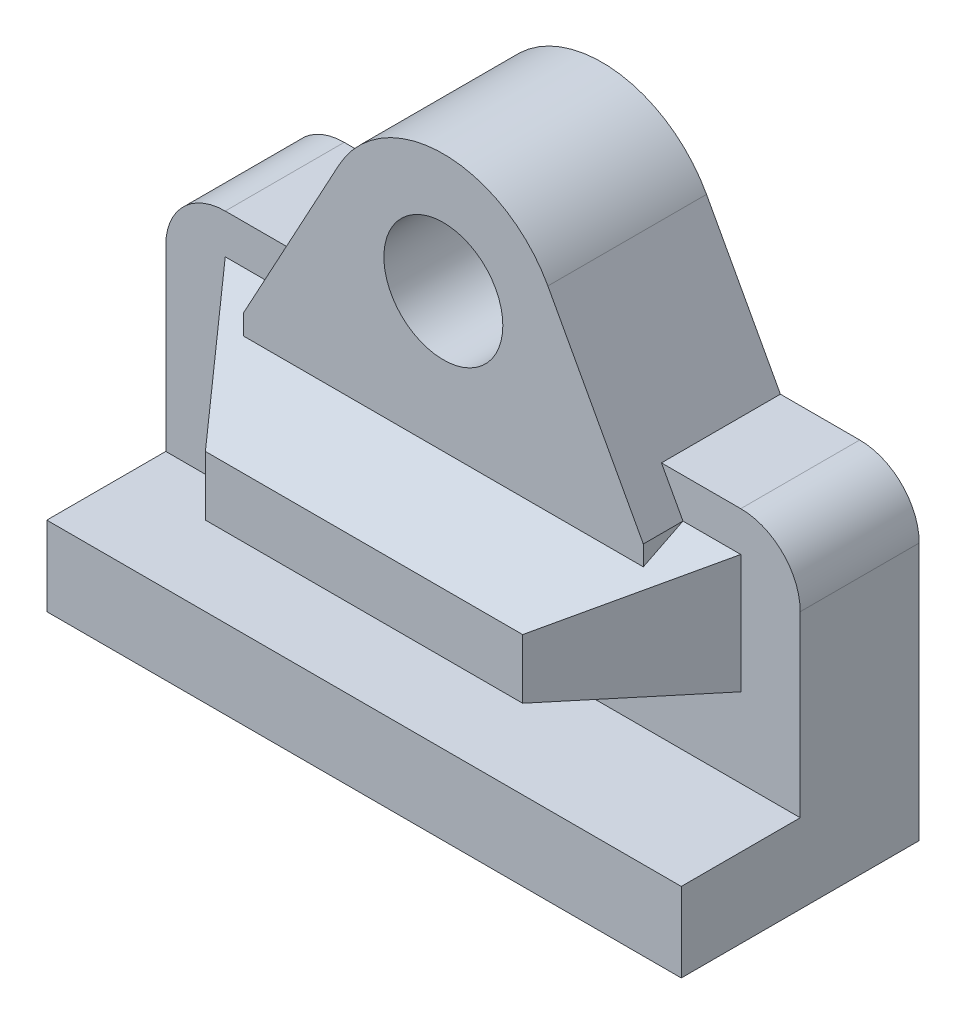
ISO-10303-21;
HEADER;
FILE_DESCRIPTION(('STEP AP214'),'2;1');
FILE_NAME('part.step','',(''),(''),'','','');
FILE_SCHEMA(('AUTOMOTIVE_DESIGN { 1 0 10303 214 1 1 1 1 }'));
ENDSEC;
DATA;
#1=APPLICATION_CONTEXT('core data for automotive mechanical design processes');
#2=APPLICATION_PROTOCOL_DEFINITION('international standard','automotive_design',2000,#1);
#3=PRODUCT_CONTEXT('',#1,'mechanical');
#4=PRODUCT('Part','Part','',(#3));
#5=PRODUCT_RELATED_PRODUCT_CATEGORY('part','',(#4));
#6=PRODUCT_DEFINITION_FORMATION('','',#4);
#7=PRODUCT_DEFINITION_CONTEXT('part definition',#1,'design');
#8=PRODUCT_DEFINITION('design','',#6,#7);
#9=PRODUCT_DEFINITION_SHAPE('','',#8);
#10=(LENGTH_UNIT() NAMED_UNIT(*) SI_UNIT(.MILLI.,.METRE.));
#11=(NAMED_UNIT(*) PLANE_ANGLE_UNIT() SI_UNIT($,.RADIAN.));
#12=(NAMED_UNIT(*) SI_UNIT($,.STERADIAN.) SOLID_ANGLE_UNIT());
#13=UNCERTAINTY_MEASURE_WITH_UNIT(LENGTH_MEASURE(1.E-05),#10,'distance_accuracy_value','');
#14=(GEOMETRIC_REPRESENTATION_CONTEXT(3) GLOBAL_UNCERTAINTY_ASSIGNED_CONTEXT((#13)) GLOBAL_UNIT_ASSIGNED_CONTEXT((#10,
#11,#12)) REPRESENTATION_CONTEXT('',''));
#15=CARTESIAN_POINT('',(0.,0.,0.));
#16=DIRECTION('',(0.,0.,1.));
#17=DIRECTION('',(1.,0.,0.));
#18=AXIS2_PLACEMENT_3D('',#15,#16,#17);
#19=CARTESIAN_POINT('',(0.,43.18,21.59));
#20=DIRECTION('',(0.,-0.894427190999916,-0.447213595499958));
#21=DIRECTION('',(0.,0.447213595499958,-0.894427190999916));
#22=AXIS2_PLACEMENT_3D('',#19,#20,#21);
#23=PLANE('',#22);
#24=DIRECTION('',(0.,-0.447213595499958,0.894427190999916));
#25=VECTOR('',#24,1.);
#26=CARTESIAN_POINT('',(82.8235256326022,30.5006067105464,46.9487865789073));
#27=LINE('',#26,#25);
#28=CARTESIAN_POINT('',(82.8235256326022,44.45,19.05));
#29=VERTEX_POINT('',#28);
#30=CARTESIAN_POINT('',(82.8235256326022,41.275,25.4));
#31=VERTEX_POINT('',#30);
#32=EDGE_CURVE('E61',#29,#31,#27,.T.);
#33=ORIENTED_EDGE('',*,*,#32,.T.);
#34=DIRECTION('',(-1.,0.,0.));
#35=VECTOR('',#34,1.);
#36=CARTESIAN_POINT('',(18.7764743673978,41.275,25.4));
#37=LINE('',#36,#35);
#38=CARTESIAN_POINT('',(18.7764743673977,41.275,25.4));
#39=VERTEX_POINT('',#38);
#40=EDGE_CURVE('E65',#31,#39,#37,.T.);
#41=ORIENTED_EDGE('',*,*,#40,.T.);
#42=DIRECTION('',(0.,0.447213595499958,-0.894427190999916));
#43=VECTOR('',#42,1.);
#44=CARTESIAN_POINT('',(18.7764743673977,30.5006067105464,46.9487865789073));
#45=LINE('',#44,#43);
#46=CARTESIAN_POINT('',(18.7764743673977,44.45,19.05));
#47=VERTEX_POINT('',#46);
#48=EDGE_CURVE('E200',#39,#47,#45,.T.);
#49=ORIENTED_EDGE('',*,*,#48,.T.);
#50=DIRECTION('',(-1.,0.,0.));
#51=VECTOR('',#50,1.);
#52=CARTESIAN_POINT('',(9.52500000000002,44.45,19.05));
#53=LINE('',#52,#51);
#54=CARTESIAN_POINT('',(9.52500000000002,44.45,19.05));
#55=VERTEX_POINT('',#54);
#56=EDGE_CURVE('E47',#47,#55,#53,.T.);
#57=ORIENTED_EDGE('',*,*,#56,.T.);
#58=DIRECTION('',(0.597614304667197,-0.358568582800319,0.717137165600636));
#59=VECTOR('',#58,1.);
#60=CARTESIAN_POINT('',(9.52500000000002,44.45,19.05));
#61=LINE('',#60,#59);
#62=CARTESIAN_POINT('',(25.4,34.925,38.1));
#63=VERTEX_POINT('',#62);
#64=EDGE_CURVE('E215',#55,#63,#61,.T.);
#65=ORIENTED_EDGE('',*,*,#64,.T.);
#66=DIRECTION('',(-1.,0.,0.));
#67=VECTOR('',#66,1.);
#68=CARTESIAN_POINT('',(76.2,34.925,38.1));
#69=LINE('',#68,#67);
#70=CARTESIAN_POINT('',(76.2,34.925,38.1));
#71=VERTEX_POINT('',#70);
#72=EDGE_CURVE('E277',#71,#63,#69,.T.);
#73=ORIENTED_EDGE('',*,*,#72,.F.);
#74=DIRECTION('',(-0.597614304667197,-0.358568582800318,0.717137165600636));
#75=VECTOR('',#74,1.);
#76=CARTESIAN_POINT('',(92.075,44.45,19.05));
#77=LINE('',#76,#75);
#78=CARTESIAN_POINT('',(92.075,44.45,19.05));
#79=VERTEX_POINT('',#78);
#80=EDGE_CURVE('E222',#79,#71,#77,.T.);
#81=ORIENTED_EDGE('',*,*,#80,.F.);
#82=EDGE_CURVE('E186',#79,#29,#53,.T.);
#83=ORIENTED_EDGE('',*,*,#82,.T.);
#84=EDGE_LOOP('',(#33,#41,#49,#57,#65,#73,#81,#83));
#85=FACE_BOUND('',#84,.T.);
#86=ADVANCED_FACE('F43',(#85),#23,.F.);
#87=CARTESIAN_POINT('',(0.,0.,19.05));
#88=DIRECTION('',(0.,0.,1.));
#89=DIRECTION('',(1.,0.,0.));
#90=AXIS2_PLACEMENT_3D('',#87,#88,#89);
#91=PLANE('',#90);
#92=ORIENTED_EDGE('',*,*,#56,.F.);
#93=DIRECTION('',(-0.477239660651135,-0.878773182511614,0.));
#94=VECTOR('',#93,1.);
#95=CARTESIAN_POINT('',(34.0593708731537,72.5914155354041,19.05));
#96=LINE('',#95,#94);
#97=CARTESIAN_POINT('',(22.2249999999999,50.8,19.05));
#98=VERTEX_POINT('',#97);
#99=EDGE_CURVE('E179',#98,#47,#96,.T.);
#100=ORIENTED_EDGE('',*,*,#99,.F.);
#101=DIRECTION('',(1.,0.,0.));
#102=VECTOR('',#101,1.);
#103=CARTESIAN_POINT('',(0.,50.8,19.05));
#104=LINE('',#103,#102);
#105=CARTESIAN_POINT('',(9.52500000000008,50.8,19.05));
#106=VERTEX_POINT('',#105);
#107=EDGE_CURVE('E459',#106,#98,#104,.T.);
#108=ORIENTED_EDGE('',*,*,#107,.F.);
#109=CARTESIAN_POINT('',(9.525,41.275,19.05));
#110=DIRECTION('',(0.,0.,1.));
#111=DIRECTION('',(1.,0.,0.));
#112=AXIS2_PLACEMENT_3D('',#109,#110,#111);
#113=CIRCLE('',#112,9.525);
#114=CARTESIAN_POINT('',(0.,41.2749999999999,19.05));
#115=VERTEX_POINT('',#114);
#116=EDGE_CURVE('E420',#115,#106,#113,.F.);
#117=ORIENTED_EDGE('',*,*,#116,.F.);
#118=DIRECTION('',(0.,1.,0.));
#119=VECTOR('',#118,1.);
#120=CARTESIAN_POINT('',(0.,0.,19.05));
#121=LINE('',#120,#119);
#122=CARTESIAN_POINT('',(0.,12.7,19.05));
#123=VERTEX_POINT('',#122);
#124=EDGE_CURVE('E415',#123,#115,#121,.T.);
#125=ORIENTED_EDGE('',*,*,#124,.F.);
#126=DIRECTION('',(-1.,0.,0.));
#127=VECTOR('',#126,1.);
#128=CARTESIAN_POINT('',(0.,12.7,19.05));
#129=LINE('',#128,#127);
#130=CARTESIAN_POINT('',(101.6,12.7,19.05));
#131=VERTEX_POINT('',#130);
#132=EDGE_CURVE('E403',#131,#123,#129,.T.);
#133=ORIENTED_EDGE('',*,*,#132,.F.);
#134=DIRECTION('',(0.,1.,0.));
#135=VECTOR('',#134,1.);
#136=CARTESIAN_POINT('',(101.6,0.,19.05));
#137=LINE('',#136,#135);
#138=CARTESIAN_POINT('',(101.6,41.2749999999999,19.05));
#139=VERTEX_POINT('',#138);
#140=EDGE_CURVE('E399',#131,#139,#137,.T.);
#141=ORIENTED_EDGE('',*,*,#140,.T.);
#142=CARTESIAN_POINT('',(92.075,41.275,19.05));
#143=DIRECTION('',(0.,0.,1.));
#144=DIRECTION('',(1.,0.,0.));
#145=AXIS2_PLACEMENT_3D('',#142,#143,#144);
#146=CIRCLE('',#145,9.52500000000001);
#147=CARTESIAN_POINT('',(92.0749999999999,50.8,19.05));
#148=VERTEX_POINT('',#147);
#149=EDGE_CURVE('E457',#139,#148,#146,.T.);
#150=ORIENTED_EDGE('',*,*,#149,.T.);
#151=DIRECTION('',(-1.,0.,0.));
#152=VECTOR('',#151,1.);
#153=CARTESIAN_POINT('',(0.,50.8,19.05));
#154=LINE('',#153,#152);
#155=CARTESIAN_POINT('',(79.375,50.8,19.05));
#156=VERTEX_POINT('',#155);
#157=EDGE_CURVE('E376',#148,#156,#154,.T.);
#158=ORIENTED_EDGE('',*,*,#157,.T.);
#159=DIRECTION('',(-0.477239660651134,0.878773182511614,0.));
#160=VECTOR('',#159,1.);
#161=CARTESIAN_POINT('',(67.5406291268463,72.5914155354041,19.05));
#162=LINE('',#161,#160);
#163=EDGE_CURVE('E197',#29,#156,#162,.T.);
#164=ORIENTED_EDGE('',*,*,#163,.F.);
#165=ORIENTED_EDGE('',*,*,#82,.F.);
#166=DIRECTION('',(0.,1.,0.));
#167=VECTOR('',#166,1.);
#168=CARTESIAN_POINT('',(92.075,25.4,19.05));
#169=LINE('',#168,#167);
#170=CARTESIAN_POINT('',(92.075,25.4,19.05));
#171=VERTEX_POINT('',#170);
#172=EDGE_CURVE('E478',#171,#79,#169,.T.);
#173=ORIENTED_EDGE('',*,*,#172,.F.);
#174=DIRECTION('',(1.,0.,0.));
#175=VECTOR('',#174,1.);
#176=CARTESIAN_POINT('',(9.52500000000002,25.4,19.05));
#177=LINE('',#176,#175);
#178=CARTESIAN_POINT('',(9.52500000000002,25.4,19.05));
#179=VERTEX_POINT('',#178);
#180=EDGE_CURVE('E216',#179,#171,#177,.T.);
#181=ORIENTED_EDGE('',*,*,#180,.F.);
#182=DIRECTION('',(0.,-1.,0.));
#183=VECTOR('',#182,1.);
#184=CARTESIAN_POINT('',(9.52500000000002,25.4,19.05));
#185=LINE('',#184,#183);
#186=EDGE_CURVE('E183',#55,#179,#185,.T.);
#187=ORIENTED_EDGE('',*,*,#186,.F.);
#188=EDGE_LOOP('',(#92,#100,#108,#117,#125,#133,#141,#150,#158,#164,#165,#173,#181,#187));
#189=FACE_BOUND('',#188,.T.);
#190=ADVANCED_FACE('F177',(#189),#91,.T.);
#191=CARTESIAN_POINT('',(101.6,0.,19.05));
#192=DIRECTION('',(-1.,0.,0.));
#193=DIRECTION('',(0.,0.,1.));
#194=AXIS2_PLACEMENT_3D('',#191,#192,#193);
#195=PLANE('',#194);
#196=DIRECTION('',(0.,1.,0.));
#197=VECTOR('',#196,1.);
#198=CARTESIAN_POINT('',(101.6,0.,0.));
#199=LINE('',#198,#197);
#200=CARTESIAN_POINT('',(101.6,0.,0.));
#201=VERTEX_POINT('',#200);
#202=CARTESIAN_POINT('',(101.6,41.2749999999999,0.));
#203=VERTEX_POINT('',#202);
#204=EDGE_CURVE('E370',#201,#203,#199,.T.);
#205=ORIENTED_EDGE('',*,*,#204,.T.);
#206=DIRECTION('',(0.,0.,-1.));
#207=VECTOR('',#206,1.);
#208=CARTESIAN_POINT('',(101.6,41.2749999999999,19.05));
#209=LINE('',#208,#207);
#210=EDGE_CURVE('E12',#139,#203,#209,.T.);
#211=ORIENTED_EDGE('',*,*,#210,.F.);
#212=ORIENTED_EDGE('',*,*,#140,.F.);
#213=DIRECTION('',(0.,0.,-1.));
#214=VECTOR('',#213,1.);
#215=CARTESIAN_POINT('',(101.6,12.7,38.1));
#216=LINE('',#215,#214);
#217=CARTESIAN_POINT('',(101.6,12.7,38.1));
#218=VERTEX_POINT('',#217);
#219=EDGE_CURVE('E452',#218,#131,#216,.T.);
#220=ORIENTED_EDGE('',*,*,#219,.F.);
#221=DIRECTION('',(0.,1.,0.));
#222=VECTOR('',#221,1.);
#223=CARTESIAN_POINT('',(101.6,0.,38.1));
#224=LINE('',#223,#222);
#225=CARTESIAN_POINT('',(101.6,0.,38.1));
#226=VERTEX_POINT('',#225);
#227=EDGE_CURVE('E446',#226,#218,#224,.T.);
#228=ORIENTED_EDGE('',*,*,#227,.F.);
#229=DIRECTION('',(0.,0.,-1.));
#230=VECTOR('',#229,1.);
#231=CARTESIAN_POINT('',(101.6,0.,38.1));
#232=LINE('',#231,#230);
#233=EDGE_CURVE('E428',#226,#201,#232,.T.);
#234=ORIENTED_EDGE('',*,*,#233,.T.);
#235=EDGE_LOOP('',(#205,#211,#212,#220,#228,#234));
#236=FACE_BOUND('',#235,.T.);
#237=ADVANCED_FACE('F316',(#236),#195,.F.);
#238=CARTESIAN_POINT('',(92.075,41.275,19.05));
#239=DIRECTION('',(0.,0.,-1.));
#240=DIRECTION('',(-1.,0.,0.));
#241=AXIS2_PLACEMENT_3D('',#238,#239,#240);
#242=CYLINDRICAL_SURFACE('',#241,9.52500000000001);
#243=CARTESIAN_POINT('',(92.075,41.275,0.));
#244=DIRECTION('',(0.,0.,1.));
#245=DIRECTION('',(1.,0.,0.));
#246=AXIS2_PLACEMENT_3D('',#243,#244,#245);
#247=CIRCLE('',#246,9.52500000000001);
#248=CARTESIAN_POINT('',(92.0749999999999,50.8,0.));
#249=VERTEX_POINT('',#248);
#250=EDGE_CURVE('E362',#203,#249,#247,.T.);
#251=ORIENTED_EDGE('',*,*,#250,.T.);
#252=DIRECTION('',(0.,0.,-1.));
#253=VECTOR('',#252,1.);
#254=CARTESIAN_POINT('',(92.0749999999999,50.8,19.05));
#255=LINE('',#254,#253);
#256=EDGE_CURVE('E53',#148,#249,#255,.T.);
#257=ORIENTED_EDGE('',*,*,#256,.F.);
#258=ORIENTED_EDGE('',*,*,#149,.F.);
#259=ORIENTED_EDGE('',*,*,#210,.T.);
#260=EDGE_LOOP('',(#251,#257,#258,#259));
#261=FACE_BOUND('',#260,.T.);
#262=ADVANCED_FACE('F321',(#261),#242,.T.);
#263=CARTESIAN_POINT('',(0.,50.8,19.05));
#264=DIRECTION('',(0.,-1.,0.));
#265=DIRECTION('',(0.,0.,-1.));
#266=AXIS2_PLACEMENT_3D('',#263,#264,#265);
#267=PLANE('',#266);
#268=DIRECTION('',(-1.,0.,0.));
#269=VECTOR('',#268,1.);
#270=CARTESIAN_POINT('',(0.,50.8,0.));
#271=LINE('',#270,#269);
#272=CARTESIAN_POINT('',(79.375,50.8,0.));
#273=VERTEX_POINT('',#272);
#274=EDGE_CURVE('E369',#249,#273,#271,.T.);
#275=ORIENTED_EDGE('',*,*,#274,.T.);
#276=DIRECTION('',(0.,0.,-1.));
#277=VECTOR('',#276,1.);
#278=CARTESIAN_POINT('',(79.375,50.8,19.05));
#279=LINE('',#278,#277);
#280=EDGE_CURVE('E377',#156,#273,#279,.T.);
#281=ORIENTED_EDGE('',*,*,#280,.F.);
#282=ORIENTED_EDGE('',*,*,#157,.F.);
#283=ORIENTED_EDGE('',*,*,#256,.T.);
#284=EDGE_LOOP('',(#275,#281,#282,#283));
#285=FACE_BOUND('',#284,.T.);
#286=ADVANCED_FACE('F352',(#285),#267,.F.);
#287=CARTESIAN_POINT('',(82.6015121655757,44.8588081881398,19.05));
#288=DIRECTION('',(0.878773182511615,0.477239660651132,0.));
#289=DIRECTION('',(-0.477239660651132,0.878773182511615,0.));
#290=AXIS2_PLACEMENT_3D('',#287,#288,#289);
#291=PLANE('',#290);
#292=DIRECTION('',(0.477239660651132,-0.878773182511615,0.));
#293=VECTOR('',#292,1.);
#294=CARTESIAN_POINT('',(82.6015121655757,44.8588081881398,0.));
#295=LINE('',#294,#293);
#296=CARTESIAN_POINT('',(67.5406291268463,72.5914155354041,0.));
#297=VERTEX_POINT('',#296);
#298=EDGE_CURVE('E381',#297,#273,#295,.T.);
#299=ORIENTED_EDGE('',*,*,#298,.F.);
#300=DIRECTION('',(0.,0.,-1.));
#301=VECTOR('',#300,1.);
#302=CARTESIAN_POINT('',(67.5406291268463,72.5914155354041,19.05));
#303=LINE('',#302,#301);
#304=CARTESIAN_POINT('',(67.5406291268463,72.5914155354041,25.4));
#305=VERTEX_POINT('',#304);
#306=EDGE_CURVE('E409',#305,#297,#303,.T.);
#307=ORIENTED_EDGE('',*,*,#306,.F.);
#308=DIRECTION('',(-0.477239660651134,0.878773182511614,0.));
#309=VECTOR('',#308,1.);
#310=CARTESIAN_POINT('',(67.5406291268463,72.5914155354041,25.4));
#311=LINE('',#310,#309);
#312=CARTESIAN_POINT('',(82.8235256326022,44.45,25.4));
#313=VERTEX_POINT('',#312);
#314=EDGE_CURVE('E209',#313,#305,#311,.T.);
#315=ORIENTED_EDGE('',*,*,#314,.F.);
#316=DIRECTION('',(0.,0.,-1.));
#317=VECTOR('',#316,1.);
#318=CARTESIAN_POINT('',(82.8235256326022,44.45,25.4));
#319=LINE('',#318,#317);
#320=EDGE_CURVE('E206',#313,#29,#319,.T.);
#321=ORIENTED_EDGE('',*,*,#320,.T.);
#322=ORIENTED_EDGE('',*,*,#163,.T.);
#323=ORIENTED_EDGE('',*,*,#280,.T.);
#324=EDGE_LOOP('',(#299,#307,#315,#321,#322,#323));
#325=FACE_BOUND('',#324,.T.);
#326=ADVANCED_FACE('F348',(#325),#291,.T.);
#327=CARTESIAN_POINT('',(50.8,63.5,19.05));
#328=DIRECTION('',(0.,0.,-1.));
#329=DIRECTION('',(-1.,0.,0.));
#330=AXIS2_PLACEMENT_3D('',#327,#328,#329);
#331=CYLINDRICAL_SURFACE('',#330,19.05);
#332=CARTESIAN_POINT('',(50.8,63.5,0.));
#333=DIRECTION('',(0.,0.,1.));
#334=DIRECTION('',(1.,0.,0.));
#335=AXIS2_PLACEMENT_3D('',#332,#333,#334);
#336=CIRCLE('',#335,19.05);
#337=CARTESIAN_POINT('',(34.0593708731537,72.5914155354041,0.));
#338=VERTEX_POINT('',#337);
#339=EDGE_CURVE('E383',#297,#338,#336,.T.);
#340=ORIENTED_EDGE('',*,*,#339,.T.);
#341=DIRECTION('',(0.,0.,-1.));
#342=VECTOR('',#341,1.);
#343=CARTESIAN_POINT('',(34.0593708731537,72.5914155354041,19.05));
#344=LINE('',#343,#342);
#345=CARTESIAN_POINT('',(34.0593708731537,72.5914155354041,25.4));
#346=VERTEX_POINT('',#345);
#347=EDGE_CURVE('E406',#346,#338,#344,.T.);
#348=ORIENTED_EDGE('',*,*,#347,.F.);
#349=CARTESIAN_POINT('',(50.8,63.5,25.4));
#350=DIRECTION('',(0.,0.,1.));
#351=DIRECTION('',(1.,0.,0.));
#352=AXIS2_PLACEMENT_3D('',#349,#350,#351);
#353=CIRCLE('',#352,19.05);
#354=EDGE_CURVE('E491',#305,#346,#353,.T.);
#355=ORIENTED_EDGE('',*,*,#354,.F.);
#356=ORIENTED_EDGE('',*,*,#306,.T.);
#357=EDGE_LOOP('',(#340,#348,#355,#356));
#358=FACE_BOUND('',#357,.T.);
#359=ADVANCED_FACE('F345',(#358),#331,.T.);
#360=CARTESIAN_POINT('',(-4.14169384533395,2.24924998236611,19.05));
#361=DIRECTION('',(0.878773182511615,-0.477239660651132,0.));
#362=DIRECTION('',(0.477239660651132,0.878773182511615,0.));
#363=AXIS2_PLACEMENT_3D('',#360,#361,#362);
#364=PLANE('',#363);
#365=DIRECTION('',(-0.477239660651132,-0.878773182511615,0.));
#366=VECTOR('',#365,1.);
#367=CARTESIAN_POINT('',(-4.14169384533395,2.24924998236611,0.));
#368=LINE('',#367,#366);
#369=CARTESIAN_POINT('',(22.225,50.8,0.));
#370=VERTEX_POINT('',#369);
#371=EDGE_CURVE('E388',#338,#370,#368,.T.);
#372=ORIENTED_EDGE('',*,*,#371,.T.);
#373=DIRECTION('',(0.,0.,-1.));
#374=VECTOR('',#373,1.);
#375=CARTESIAN_POINT('',(22.225,50.8,19.05));
#376=LINE('',#375,#374);
#377=EDGE_CURVE('E195',#98,#370,#376,.T.);
#378=ORIENTED_EDGE('',*,*,#377,.F.);
#379=ORIENTED_EDGE('',*,*,#99,.T.);
#380=DIRECTION('',(0.,0.,-1.));
#381=VECTOR('',#380,1.);
#382=CARTESIAN_POINT('',(18.7764743673977,44.45,25.4));
#383=LINE('',#382,#381);
#384=CARTESIAN_POINT('',(18.7764743673977,44.45,25.4));
#385=VERTEX_POINT('',#384);
#386=EDGE_CURVE('E193',#385,#47,#383,.T.);
#387=ORIENTED_EDGE('',*,*,#386,.F.);
#388=DIRECTION('',(-0.477239660651135,-0.878773182511614,0.));
#389=VECTOR('',#388,1.);
#390=CARTESIAN_POINT('',(34.0593708731537,72.5914155354041,25.4));
#391=LINE('',#390,#389);
#392=EDGE_CURVE('E493',#346,#385,#391,.T.);
#393=ORIENTED_EDGE('',*,*,#392,.F.);
#394=ORIENTED_EDGE('',*,*,#347,.T.);
#395=EDGE_LOOP('',(#372,#378,#379,#387,#393,#394));
#396=FACE_BOUND('',#395,.T.);
#397=ADVANCED_FACE('F190',(#396),#364,.F.);
#398=CARTESIAN_POINT('',(0.,50.8,19.05));
#399=DIRECTION('',(0.,1.,0.));
#400=DIRECTION('',(-1.,0.,0.));
#401=AXIS2_PLACEMENT_3D('',#398,#399,#400);
#402=PLANE('',#401);
#403=DIRECTION('',(1.,0.,0.));
#404=VECTOR('',#403,1.);
#405=CARTESIAN_POINT('',(0.,50.8,0.));
#406=LINE('',#405,#404);
#407=CARTESIAN_POINT('',(9.52500000000008,50.8,0.));
#408=VERTEX_POINT('',#407);
#409=EDGE_CURVE('E390',#408,#370,#406,.T.);
#410=ORIENTED_EDGE('',*,*,#409,.F.);
#411=DIRECTION('',(0.,0.,-1.));
#412=VECTOR('',#411,1.);
#413=CARTESIAN_POINT('',(9.52500000000008,50.8,19.05));
#414=LINE('',#413,#412);
#415=EDGE_CURVE('E402',#106,#408,#414,.T.);
#416=ORIENTED_EDGE('',*,*,#415,.F.);
#417=ORIENTED_EDGE('',*,*,#107,.T.);
#418=ORIENTED_EDGE('',*,*,#377,.T.);
#419=EDGE_LOOP('',(#410,#416,#417,#418));
#420=FACE_BOUND('',#419,.T.);
#421=ADVANCED_FACE('F338',(#420),#402,.T.);
#422=CARTESIAN_POINT('',(9.525,41.275,19.05));
#423=DIRECTION('',(0.,0.,-1.));
#424=DIRECTION('',(-1.,0.,0.));
#425=AXIS2_PLACEMENT_3D('',#422,#423,#424);
#426=CYLINDRICAL_SURFACE('',#425,9.525);
#427=CARTESIAN_POINT('',(9.525,41.275,0.));
#428=DIRECTION('',(0.,0.,1.));
#429=DIRECTION('',(1.,0.,0.));
#430=AXIS2_PLACEMENT_3D('',#427,#428,#429);
#431=CIRCLE('',#430,9.525);
#432=CARTESIAN_POINT('',(0.,41.2749999999999,0.));
#433=VERTEX_POINT('',#432);
#434=EDGE_CURVE('E393',#433,#408,#431,.F.);
#435=ORIENTED_EDGE('',*,*,#434,.F.);
#436=DIRECTION('',(0.,0.,-1.));
#437=VECTOR('',#436,1.);
#438=CARTESIAN_POINT('',(0.,41.2749999999999,19.05));
#439=LINE('',#438,#437);
#440=EDGE_CURVE('E400',#115,#433,#439,.T.);
#441=ORIENTED_EDGE('',*,*,#440,.F.);
#442=ORIENTED_EDGE('',*,*,#116,.T.);
#443=ORIENTED_EDGE('',*,*,#415,.T.);
#444=EDGE_LOOP('',(#435,#441,#442,#443));
#445=FACE_BOUND('',#444,.T.);
#446=ADVANCED_FACE('F334',(#445),#426,.T.);
#447=CARTESIAN_POINT('',(0.,0.,19.05));
#448=DIRECTION('',(-1.,0.,0.));
#449=DIRECTION('',(0.,0.,1.));
#450=AXIS2_PLACEMENT_3D('',#447,#448,#449);
#451=PLANE('',#450);
#452=DIRECTION('',(0.,1.,0.));
#453=VECTOR('',#452,1.);
#454=CARTESIAN_POINT('',(0.,0.,0.));
#455=LINE('',#454,#453);
#456=CARTESIAN_POINT('',(0.,0.,0.));
#457=VERTEX_POINT('',#456);
#458=EDGE_CURVE('E396',#457,#433,#455,.T.);
#459=ORIENTED_EDGE('',*,*,#458,.F.);
#460=DIRECTION('',(0.,0.,-1.));
#461=VECTOR('',#460,1.);
#462=CARTESIAN_POINT('',(0.,0.,38.1));
#463=LINE('',#462,#461);
#464=CARTESIAN_POINT('',(0.,0.,38.1));
#465=VERTEX_POINT('',#464);
#466=EDGE_CURVE('E437',#465,#457,#463,.T.);
#467=ORIENTED_EDGE('',*,*,#466,.F.);
#468=DIRECTION('',(0.,-1.,0.));
#469=VECTOR('',#468,1.);
#470=CARTESIAN_POINT('',(0.,0.,38.1));
#471=LINE('',#470,#469);
#472=CARTESIAN_POINT('',(0.,12.7,38.1));
#473=VERTEX_POINT('',#472);
#474=EDGE_CURVE('E441',#473,#465,#471,.T.);
#475=ORIENTED_EDGE('',*,*,#474,.F.);
#476=DIRECTION('',(0.,0.,-1.));
#477=VECTOR('',#476,1.);
#478=CARTESIAN_POINT('',(0.,12.7,38.1));
#479=LINE('',#478,#477);
#480=EDGE_CURVE('E424',#473,#123,#479,.T.);
#481=ORIENTED_EDGE('',*,*,#480,.T.);
#482=ORIENTED_EDGE('',*,*,#124,.T.);
#483=ORIENTED_EDGE('',*,*,#440,.T.);
#484=EDGE_LOOP('',(#459,#467,#475,#481,#482,#483));
#485=FACE_BOUND('',#484,.T.);
#486=ADVANCED_FACE('F331',(#485),#451,.T.);
#487=CARTESIAN_POINT('',(50.8,63.5,19.05));
#488=DIRECTION('',(0.,0.,-1.));
#489=DIRECTION('',(-1.,0.,0.));
#490=AXIS2_PLACEMENT_3D('',#487,#488,#489);
#491=CYLINDRICAL_SURFACE('',#490,9.52500000000001);
#492=CARTESIAN_POINT('',(50.8,63.5,0.));
#493=DIRECTION('',(0.,0.,1.));
#494=DIRECTION('',(1.,0.,0.));
#495=AXIS2_PLACEMENT_3D('',#492,#493,#494);
#496=CIRCLE('',#495,9.52500000000001);
#497=CARTESIAN_POINT('',(60.325,63.5,0.));
#498=VERTEX_POINT('',#497);
#499=EDGE_CURVE('E422',#498,#498,#496,.T.);
#500=ORIENTED_EDGE('',*,*,#499,.F.);
#501=EDGE_LOOP('',(#500));
#502=FACE_BOUND('',#501,.T.);
#503=CARTESIAN_POINT('',(50.8,63.5,25.4));
#504=DIRECTION('',(0.,0.,1.));
#505=DIRECTION('',(1.,0.,0.));
#506=AXIS2_PLACEMENT_3D('',#503,#504,#505);
#507=CIRCLE('',#506,9.52500000000002);
#508=CARTESIAN_POINT('',(60.325,63.5,25.4));
#509=VERTEX_POINT('',#508);
#510=EDGE_CURVE('E198',#509,#509,#507,.T.);
#511=ORIENTED_EDGE('',*,*,#510,.T.);
#512=EDGE_LOOP('',(#511));
#513=FACE_BOUND('',#512,.T.);
#514=ADVANCED_FACE('F45',(#502,#513),#491,.F.);
#515=CARTESIAN_POINT('',(0.,0.,0.));
#516=DIRECTION('',(0.,0.,1.));
#517=DIRECTION('',(1.,0.,0.));
#518=AXIS2_PLACEMENT_3D('',#515,#516,#517);
#519=PLANE('',#518);
#520=ORIENTED_EDGE('',*,*,#499,.T.);
#521=EDGE_LOOP('',(#520));
#522=FACE_BOUND('',#521,.T.);
#523=ORIENTED_EDGE('',*,*,#204,.F.);
#524=DIRECTION('',(1.,0.,0.));
#525=VECTOR('',#524,1.);
#526=CARTESIAN_POINT('',(0.,0.,0.));
#527=LINE('',#526,#525);
#528=EDGE_CURVE('E431',#457,#201,#527,.T.);
#529=ORIENTED_EDGE('',*,*,#528,.F.);
#530=ORIENTED_EDGE('',*,*,#458,.T.);
#531=ORIENTED_EDGE('',*,*,#434,.T.);
#532=ORIENTED_EDGE('',*,*,#409,.T.);
#533=ORIENTED_EDGE('',*,*,#371,.F.);
#534=ORIENTED_EDGE('',*,*,#339,.F.);
#535=ORIENTED_EDGE('',*,*,#298,.T.);
#536=ORIENTED_EDGE('',*,*,#274,.F.);
#537=ORIENTED_EDGE('',*,*,#250,.F.);
#538=EDGE_LOOP('',(#523,#529,#530,#531,#532,#533,#534,#535,#536,#537));
#539=FACE_BOUND('',#538,.T.);
#540=ADVANCED_FACE('F327',(#522,#539),#519,.F.);
#541=CARTESIAN_POINT('',(0.,12.7,38.1));
#542=DIRECTION('',(0.,-1.,0.));
#543=DIRECTION('',(1.,0.,0.));
#544=AXIS2_PLACEMENT_3D('',#541,#542,#543);
#545=PLANE('',#544);
#546=ORIENTED_EDGE('',*,*,#219,.T.);
#547=ORIENTED_EDGE('',*,*,#132,.T.);
#548=ORIENTED_EDGE('',*,*,#480,.F.);
#549=DIRECTION('',(-1.,0.,0.));
#550=VECTOR('',#549,1.);
#551=CARTESIAN_POINT('',(0.,12.7,38.1));
#552=LINE('',#551,#550);
#553=EDGE_CURVE('E438',#218,#473,#552,.T.);
#554=ORIENTED_EDGE('',*,*,#553,.F.);
#555=EDGE_LOOP('',(#546,#547,#548,#554));
#556=FACE_BOUND('',#555,.T.);
#557=ADVANCED_FACE('F325',(#556),#545,.F.);
#558=CARTESIAN_POINT('',(0.,0.,38.1));
#559=DIRECTION('',(0.,1.,0.));
#560=DIRECTION('',(0.,0.,1.));
#561=AXIS2_PLACEMENT_3D('',#558,#559,#560);
#562=PLANE('',#561);
#563=ORIENTED_EDGE('',*,*,#528,.T.);
#564=ORIENTED_EDGE('',*,*,#233,.F.);
#565=DIRECTION('',(1.,0.,0.));
#566=VECTOR('',#565,1.);
#567=CARTESIAN_POINT('',(0.,0.,38.1));
#568=LINE('',#567,#566);
#569=EDGE_CURVE('E512',#465,#226,#568,.T.);
#570=ORIENTED_EDGE('',*,*,#569,.F.);
#571=ORIENTED_EDGE('',*,*,#466,.T.);
#572=EDGE_LOOP('',(#563,#564,#570,#571));
#573=FACE_BOUND('',#572,.T.);
#574=ADVANCED_FACE('F434',(#573),#562,.F.);
#575=CARTESIAN_POINT('',(0.,0.,38.1));
#576=DIRECTION('',(0.,0.,1.));
#577=DIRECTION('',(1.,0.,0.));
#578=AXIS2_PLACEMENT_3D('',#575,#576,#577);
#579=PLANE('',#578);
#580=ORIENTED_EDGE('',*,*,#553,.T.);
#581=ORIENTED_EDGE('',*,*,#474,.T.);
#582=ORIENTED_EDGE('',*,*,#569,.T.);
#583=ORIENTED_EDGE('',*,*,#227,.T.);
#584=EDGE_LOOP('',(#580,#581,#582,#583));
#585=FACE_BOUND('',#584,.T.);
#586=ADVANCED_FACE('F556',(#585),#579,.T.);
#587=CARTESIAN_POINT('',(0.,0.,38.1));
#588=DIRECTION('',(0.,0.,1.));
#589=DIRECTION('',(1.,0.,0.));
#590=AXIS2_PLACEMENT_3D('',#587,#588,#589);
#591=PLANE('',#590);
#592=DIRECTION('',(0.,1.,0.));
#593=VECTOR('',#592,1.);
#594=CARTESIAN_POINT('',(76.2,25.4,38.1));
#595=LINE('',#594,#593);
#596=CARTESIAN_POINT('',(76.2,25.4,38.1));
#597=VERTEX_POINT('',#596);
#598=EDGE_CURVE('E227',#597,#71,#595,.T.);
#599=ORIENTED_EDGE('',*,*,#598,.T.);
#600=ORIENTED_EDGE('',*,*,#72,.T.);
#601=DIRECTION('',(0.,-1.,0.));
#602=VECTOR('',#601,1.);
#603=CARTESIAN_POINT('',(25.4,25.4,38.1));
#604=LINE('',#603,#602);
#605=CARTESIAN_POINT('',(25.4,25.4,38.1));
#606=VERTEX_POINT('',#605);
#607=EDGE_CURVE('E288',#63,#606,#604,.T.);
#608=ORIENTED_EDGE('',*,*,#607,.T.);
#609=DIRECTION('',(1.,0.,0.));
#610=VECTOR('',#609,1.);
#611=CARTESIAN_POINT('',(25.4,25.4,38.1));
#612=LINE('',#611,#610);
#613=EDGE_CURVE('E236',#606,#597,#612,.T.);
#614=ORIENTED_EDGE('',*,*,#613,.T.);
#615=EDGE_LOOP('',(#599,#600,#608,#614));
#616=FACE_BOUND('',#615,.T.);
#617=ADVANCED_FACE('F263',(#616),#591,.T.);
#618=CARTESIAN_POINT('',(-3.74754098360654,0.,3.12295081967212));
#619=DIRECTION('',(0.768221279597376,0.,-0.64018439966448));
#620=DIRECTION('',(-0.64018439966448,0.,-0.768221279597376));
#621=AXIS2_PLACEMENT_3D('',#618,#619,#620);
#622=PLANE('',#621);
#623=DIRECTION('',(0.64018439966448,0.,0.768221279597376));
#624=VECTOR('',#623,1.);
#625=CARTESIAN_POINT('',(9.52500000000002,25.4,19.05));
#626=LINE('',#625,#624);
#627=EDGE_CURVE('E213',#179,#606,#626,.T.);
#628=ORIENTED_EDGE('',*,*,#627,.T.);
#629=ORIENTED_EDGE('',*,*,#607,.F.);
#630=ORIENTED_EDGE('',*,*,#64,.F.);
#631=ORIENTED_EDGE('',*,*,#186,.T.);
#632=EDGE_LOOP('',(#628,#629,#630,#631));
#633=FACE_BOUND('',#632,.T.);
#634=ADVANCED_FACE('F255',(#633),#622,.F.);
#635=CARTESIAN_POINT('',(0.,25.4,0.));
#636=DIRECTION('',(0.,1.,0.));
#637=DIRECTION('',(-1.,0.,0.));
#638=AXIS2_PLACEMENT_3D('',#635,#636,#637);
#639=PLANE('',#638);
#640=DIRECTION('',(-0.64018439966448,0.,0.768221279597376));
#641=VECTOR('',#640,1.);
#642=CARTESIAN_POINT('',(92.075,25.4,19.05));
#643=LINE('',#642,#641);
#644=EDGE_CURVE('E219',#171,#597,#643,.T.);
#645=ORIENTED_EDGE('',*,*,#644,.T.);
#646=ORIENTED_EDGE('',*,*,#613,.F.);
#647=ORIENTED_EDGE('',*,*,#627,.F.);
#648=ORIENTED_EDGE('',*,*,#180,.T.);
#649=EDGE_LOOP('',(#645,#646,#647,#648));
#650=FACE_BOUND('',#649,.T.);
#651=ADVANCED_FACE('F244',(#650),#639,.F.);
#652=CARTESIAN_POINT('',(63.7081967213115,0.,53.0901639344263));
#653=DIRECTION('',(-0.768221279597376,0.,-0.64018439966448));
#654=DIRECTION('',(-0.64018439966448,0.,0.768221279597376));
#655=AXIS2_PLACEMENT_3D('',#652,#653,#654);
#656=PLANE('',#655);
#657=ORIENTED_EDGE('',*,*,#80,.T.);
#658=ORIENTED_EDGE('',*,*,#598,.F.);
#659=ORIENTED_EDGE('',*,*,#644,.F.);
#660=ORIENTED_EDGE('',*,*,#172,.T.);
#661=EDGE_LOOP('',(#657,#658,#659,#660));
#662=FACE_BOUND('',#661,.T.);
#663=ADVANCED_FACE('F254',(#662),#656,.F.);
#664=CARTESIAN_POINT('',(50.8,63.5,25.4));
#665=DIRECTION('',(0.,0.,1.));
#666=DIRECTION('',(1.,0.,0.));
#667=AXIS2_PLACEMENT_3D('',#664,#665,#666);
#668=PLANE('',#667);
#669=ORIENTED_EDGE('',*,*,#354,.T.);
#670=ORIENTED_EDGE('',*,*,#392,.T.);
#671=DIRECTION('',(0.,1.,0.));
#672=VECTOR('',#671,1.);
#673=CARTESIAN_POINT('',(18.7764743673977,-25.2969664472682,25.4));
#674=LINE('',#673,#672);
#675=EDGE_CURVE('E205',#39,#385,#674,.T.);
#676=ORIENTED_EDGE('',*,*,#675,.F.);
#677=ORIENTED_EDGE('',*,*,#40,.F.);
#678=DIRECTION('',(0.,1.,0.));
#679=VECTOR('',#678,1.);
#680=CARTESIAN_POINT('',(82.8235256326022,-25.2969664472682,25.4));
#681=LINE('',#680,#679);
#682=EDGE_CURVE('E502',#31,#313,#681,.T.);
#683=ORIENTED_EDGE('',*,*,#682,.T.);
#684=ORIENTED_EDGE('',*,*,#314,.T.);
#685=EDGE_LOOP('',(#669,#670,#676,#677,#683,#684));
#686=FACE_BOUND('',#685,.T.);
#687=ORIENTED_EDGE('',*,*,#510,.F.);
#688=EDGE_LOOP('',(#687));
#689=FACE_BOUND('',#688,.T.);
#690=ADVANCED_FACE('F261',(#686,#689),#668,.T.);
#691=CARTESIAN_POINT('',(82.8235256326022,-25.2969664472682,19.05));
#692=DIRECTION('',(-1.,0.,0.));
#693=DIRECTION('',(0.,0.,1.));
#694=AXIS2_PLACEMENT_3D('',#691,#692,#693);
#695=PLANE('',#694);
#696=ORIENTED_EDGE('',*,*,#32,.F.);
#697=ORIENTED_EDGE('',*,*,#320,.F.);
#698=ORIENTED_EDGE('',*,*,#682,.F.);
#699=EDGE_LOOP('',(#696,#697,#698));
#700=FACE_BOUND('',#699,.T.);
#701=ADVANCED_FACE('F304',(#700),#695,.F.);
#702=CARTESIAN_POINT('',(18.7764743673977,-25.2969664472682,19.05));
#703=DIRECTION('',(1.,0.,0.));
#704=DIRECTION('',(0.,0.,-1.));
#705=AXIS2_PLACEMENT_3D('',#702,#703,#704);
#706=PLANE('',#705);
#707=ORIENTED_EDGE('',*,*,#48,.F.);
#708=ORIENTED_EDGE('',*,*,#675,.T.);
#709=ORIENTED_EDGE('',*,*,#386,.T.);
#710=EDGE_LOOP('',(#707,#708,#709));
#711=FACE_BOUND('',#710,.T.);
#712=ADVANCED_FACE('F204',(#711),#706,.F.);
#713=CLOSED_SHELL('',(#86,#190,#237,#262,#286,#326,#359,#397,#421,#446,#486,#514,#540,#557,#574,
#586,#617,#634,#651,#663,#690,#701,#712));
#714=MANIFOLD_SOLID_BREP('B2',#713);
#715=ADVANCED_BREP_SHAPE_REPRESENTATION('',(#18,#714),#14);
#716=SHAPE_DEFINITION_REPRESENTATION(#9,#715);
ENDSEC;
END-ISO-10303-21;
